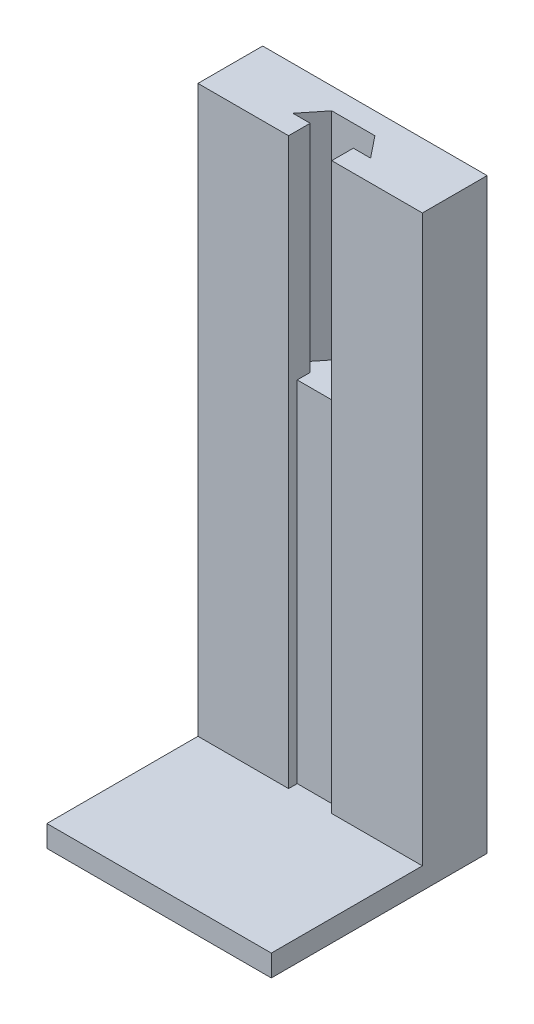
ISO-10303-21;
HEADER;
FILE_DESCRIPTION(('STEP AP214'),'2;1');
FILE_NAME('part.step','',(''),(''),'','','');
FILE_SCHEMA(('AUTOMOTIVE_DESIGN { 1 0 10303 214 1 1 1 1 }'));
ENDSEC;
DATA;
#1=APPLICATION_CONTEXT('core data for automotive mechanical design processes');
#2=APPLICATION_PROTOCOL_DEFINITION('international standard','automotive_design',2000,#1);
#3=PRODUCT_CONTEXT('',#1,'mechanical');
#4=PRODUCT('Part','Part','',(#3));
#5=PRODUCT_RELATED_PRODUCT_CATEGORY('part','',(#4));
#6=PRODUCT_DEFINITION_FORMATION('','',#4);
#7=PRODUCT_DEFINITION_CONTEXT('part definition',#1,'design');
#8=PRODUCT_DEFINITION('design','',#6,#7);
#9=PRODUCT_DEFINITION_SHAPE('','',#8);
#10=(LENGTH_UNIT() NAMED_UNIT(*) SI_UNIT(.MILLI.,.METRE.));
#11=(NAMED_UNIT(*) PLANE_ANGLE_UNIT() SI_UNIT($,.RADIAN.));
#12=(NAMED_UNIT(*) SI_UNIT($,.STERADIAN.) SOLID_ANGLE_UNIT());
#13=UNCERTAINTY_MEASURE_WITH_UNIT(LENGTH_MEASURE(1.E-05),#10,'distance_accuracy_value','');
#14=(GEOMETRIC_REPRESENTATION_CONTEXT(3) GLOBAL_UNCERTAINTY_ASSIGNED_CONTEXT((#13)) GLOBAL_UNIT_ASSIGNED_CONTEXT((#10,
#11,#12)) REPRESENTATION_CONTEXT('',''));
#15=CARTESIAN_POINT('',(0.,0.,0.));
#16=DIRECTION('',(0.,0.,1.));
#17=DIRECTION('',(1.,0.,0.));
#18=AXIS2_PLACEMENT_3D('',#15,#16,#17);
#19=CARTESIAN_POINT('',(-26.,136.,-10.));
#20=DIRECTION('',(0.,0.,-1.));
#21=DIRECTION('',(-1.,0.,0.));
#22=AXIS2_PLACEMENT_3D('',#19,#20,#21);
#23=PLANE('',#22);
#24=DIRECTION('',(1.,0.,0.));
#25=VECTOR('',#24,1.);
#26=CARTESIAN_POINT('',(-26.,5.,-10.));
#27=LINE('',#26,#25);
#28=CARTESIAN_POINT('',(-26.,5.,-10.));
#29=VERTEX_POINT('',#28);
#30=CARTESIAN_POINT('',(-5.,5.,-10.));
#31=VERTEX_POINT('',#30);
#32=EDGE_CURVE('E66',#29,#31,#27,.T.);
#33=ORIENTED_EDGE('',*,*,#32,.T.);
#34=DIRECTION('',(0.,1.,0.));
#35=VECTOR('',#34,1.);
#36=CARTESIAN_POINT('',(-5.,86.,-10.));
#37=LINE('',#36,#35);
#38=CARTESIAN_POINT('',(-5.,136.,-10.));
#39=VERTEX_POINT('',#38);
#40=EDGE_CURVE('E158',#31,#39,#37,.T.);
#41=ORIENTED_EDGE('',*,*,#40,.T.);
#42=DIRECTION('',(1.,0.,0.));
#43=VECTOR('',#42,1.);
#44=CARTESIAN_POINT('',(-26.,136.,-10.));
#45=LINE('',#44,#43);
#46=CARTESIAN_POINT('',(-26.,136.,-10.));
#47=VERTEX_POINT('',#46);
#48=EDGE_CURVE('E299',#47,#39,#45,.T.);
#49=ORIENTED_EDGE('',*,*,#48,.F.);
#50=DIRECTION('',(0.,-1.,0.));
#51=VECTOR('',#50,1.);
#52=CARTESIAN_POINT('',(-26.,136.,-10.));
#53=LINE('',#52,#51);
#54=EDGE_CURVE('E177',#47,#29,#53,.T.);
#55=ORIENTED_EDGE('',*,*,#54,.T.);
#56=EDGE_LOOP('',(#33,#41,#49,#55));
#57=FACE_BOUND('',#56,.T.);
#58=ADVANCED_FACE('F43',(#57),#23,.F.);
#59=CARTESIAN_POINT('',(0.,5.,0.));
#60=DIRECTION('',(0.,-1.,0.));
#61=DIRECTION('',(0.,0.,-1.));
#62=AXIS2_PLACEMENT_3D('',#59,#60,#61);
#63=PLANE('',#62);
#64=ORIENTED_EDGE('',*,*,#32,.F.);
#65=DIRECTION('',(0.,0.,1.));
#66=VECTOR('',#65,1.);
#67=CARTESIAN_POINT('',(-26.,5.,25.));
#68=LINE('',#67,#66);
#69=CARTESIAN_POINT('',(-26.,5.,25.));
#70=VERTEX_POINT('',#69);
#71=EDGE_CURVE('E197',#29,#70,#68,.T.);
#72=ORIENTED_EDGE('',*,*,#71,.T.);
#73=DIRECTION('',(1.,0.,0.));
#74=VECTOR('',#73,1.);
#75=CARTESIAN_POINT('',(-26.,5.,25.));
#76=LINE('',#75,#74);
#77=CARTESIAN_POINT('',(26.,5.,25.));
#78=VERTEX_POINT('',#77);
#79=EDGE_CURVE('E200',#70,#78,#76,.T.);
#80=ORIENTED_EDGE('',*,*,#79,.T.);
#81=DIRECTION('',(0.,0.,-1.));
#82=VECTOR('',#81,1.);
#83=CARTESIAN_POINT('',(26.,5.,25.));
#84=LINE('',#83,#82);
#85=CARTESIAN_POINT('',(26.,5.,-10.));
#86=VERTEX_POINT('',#85);
#87=EDGE_CURVE('E194',#78,#86,#84,.T.);
#88=ORIENTED_EDGE('',*,*,#87,.T.);
#89=CARTESIAN_POINT('',(5.,5.,-10.));
#90=VERTEX_POINT('',#89);
#91=EDGE_CURVE('E179',#90,#86,#27,.T.);
#92=ORIENTED_EDGE('',*,*,#91,.F.);
#93=DIRECTION('',(0.,0.,-1.));
#94=VECTOR('',#93,1.);
#95=CARTESIAN_POINT('',(5.,5.,-10.));
#96=LINE('',#95,#94);
#97=CARTESIAN_POINT('',(5.,5.,-12.));
#98=VERTEX_POINT('',#97);
#99=EDGE_CURVE('E172',#90,#98,#96,.T.);
#100=ORIENTED_EDGE('',*,*,#99,.T.);
#101=DIRECTION('',(-1.,0.,0.));
#102=VECTOR('',#101,1.);
#103=CARTESIAN_POINT('',(-5.,5.,-12.));
#104=LINE('',#103,#102);
#105=CARTESIAN_POINT('',(-5.,5.,-12.));
#106=VERTEX_POINT('',#105);
#107=EDGE_CURVE('E171',#98,#106,#104,.T.);
#108=ORIENTED_EDGE('',*,*,#107,.T.);
#109=DIRECTION('',(0.,0.,1.));
#110=VECTOR('',#109,1.);
#111=CARTESIAN_POINT('',(-5.,5.,-10.));
#112=LINE('',#111,#110);
#113=EDGE_CURVE('E160',#106,#31,#112,.T.);
#114=ORIENTED_EDGE('',*,*,#113,.T.);
#115=EDGE_LOOP('',(#64,#72,#80,#88,#92,#100,#108,#114));
#116=FACE_BOUND('',#115,.T.);
#117=ADVANCED_FACE('F168',(#116),#63,.F.);
#118=CARTESIAN_POINT('',(26.,5.,25.));
#119=DIRECTION('',(-1.,0.,0.));
#120=DIRECTION('',(0.,0.,1.));
#121=AXIS2_PLACEMENT_3D('',#118,#119,#120);
#122=PLANE('',#121);
#123=DIRECTION('',(0.,0.,-1.));
#124=VECTOR('',#123,1.);
#125=CARTESIAN_POINT('',(26.,0.,25.));
#126=LINE('',#125,#124);
#127=CARTESIAN_POINT('',(26.,0.,25.));
#128=VERTEX_POINT('',#127);
#129=CARTESIAN_POINT('',(26.,0.,-25.));
#130=VERTEX_POINT('',#129);
#131=EDGE_CURVE('E193',#128,#130,#126,.T.);
#132=ORIENTED_EDGE('',*,*,#131,.T.);
#133=DIRECTION('',(0.,-1.,0.));
#134=VECTOR('',#133,1.);
#135=CARTESIAN_POINT('',(26.,5.,-25.));
#136=LINE('',#135,#134);
#137=CARTESIAN_POINT('',(26.,136.,-25.));
#138=VERTEX_POINT('',#137);
#139=EDGE_CURVE('E12',#138,#130,#136,.T.);
#140=ORIENTED_EDGE('',*,*,#139,.F.);
#141=DIRECTION('',(0.,0.,-1.));
#142=VECTOR('',#141,1.);
#143=CARTESIAN_POINT('',(26.,136.,-25.));
#144=LINE('',#143,#142);
#145=CARTESIAN_POINT('',(26.,136.,-10.));
#146=VERTEX_POINT('',#145);
#147=EDGE_CURVE('E300',#146,#138,#144,.T.);
#148=ORIENTED_EDGE('',*,*,#147,.F.);
#149=DIRECTION('',(0.,-1.,0.));
#150=VECTOR('',#149,1.);
#151=CARTESIAN_POINT('',(26.,136.,-10.));
#152=LINE('',#151,#150);
#153=EDGE_CURVE('E189',#146,#86,#152,.T.);
#154=ORIENTED_EDGE('',*,*,#153,.T.);
#155=ORIENTED_EDGE('',*,*,#87,.F.);
#156=DIRECTION('',(0.,-1.,0.));
#157=VECTOR('',#156,1.);
#158=CARTESIAN_POINT('',(26.,5.,25.));
#159=LINE('',#158,#157);
#160=EDGE_CURVE('E202',#78,#128,#159,.T.);
#161=ORIENTED_EDGE('',*,*,#160,.T.);
#162=EDGE_LOOP('',(#132,#140,#148,#154,#155,#161));
#163=FACE_BOUND('',#162,.T.);
#164=ADVANCED_FACE('F45',(#163),#122,.F.);
#165=CARTESIAN_POINT('',(-26.,5.,-25.));
#166=DIRECTION('',(0.,0.,1.));
#167=DIRECTION('',(1.,0.,0.));
#168=AXIS2_PLACEMENT_3D('',#165,#166,#167);
#169=PLANE('',#168);
#170=DIRECTION('',(-1.,0.,0.));
#171=VECTOR('',#170,1.);
#172=CARTESIAN_POINT('',(-26.,0.,-25.));
#173=LINE('',#172,#171);
#174=CARTESIAN_POINT('',(-26.,0.,-25.));
#175=VERTEX_POINT('',#174);
#176=EDGE_CURVE('E205',#130,#175,#173,.T.);
#177=ORIENTED_EDGE('',*,*,#176,.T.);
#178=DIRECTION('',(0.,-1.,0.));
#179=VECTOR('',#178,1.);
#180=CARTESIAN_POINT('',(-26.,5.,-25.));
#181=LINE('',#180,#179);
#182=CARTESIAN_POINT('',(-26.,136.,-25.));
#183=VERTEX_POINT('',#182);
#184=EDGE_CURVE('E51',#183,#175,#181,.T.);
#185=ORIENTED_EDGE('',*,*,#184,.F.);
#186=DIRECTION('',(-1.,0.,0.));
#187=VECTOR('',#186,1.);
#188=CARTESIAN_POINT('',(-26.,136.,-25.));
#189=LINE('',#188,#187);
#190=EDGE_CURVE('E187',#138,#183,#189,.T.);
#191=ORIENTED_EDGE('',*,*,#190,.F.);
#192=ORIENTED_EDGE('',*,*,#139,.T.);
#193=EDGE_LOOP('',(#177,#185,#191,#192));
#194=FACE_BOUND('',#193,.T.);
#195=ADVANCED_FACE('F304',(#194),#169,.F.);
#196=CARTESIAN_POINT('',(-26.,5.,25.));
#197=DIRECTION('',(1.,0.,0.));
#198=DIRECTION('',(0.,0.,-1.));
#199=AXIS2_PLACEMENT_3D('',#196,#197,#198);
#200=PLANE('',#199);
#201=DIRECTION('',(0.,0.,1.));
#202=VECTOR('',#201,1.);
#203=CARTESIAN_POINT('',(-26.,0.,25.));
#204=LINE('',#203,#202);
#205=CARTESIAN_POINT('',(-26.,0.,25.));
#206=VERTEX_POINT('',#205);
#207=EDGE_CURVE('E207',#175,#206,#204,.T.);
#208=ORIENTED_EDGE('',*,*,#207,.T.);
#209=DIRECTION('',(0.,-1.,0.));
#210=VECTOR('',#209,1.);
#211=CARTESIAN_POINT('',(-26.,5.,25.));
#212=LINE('',#211,#210);
#213=EDGE_CURVE('E212',#70,#206,#212,.T.);
#214=ORIENTED_EDGE('',*,*,#213,.F.);
#215=ORIENTED_EDGE('',*,*,#71,.F.);
#216=ORIENTED_EDGE('',*,*,#54,.F.);
#217=DIRECTION('',(0.,0.,1.));
#218=VECTOR('',#217,1.);
#219=CARTESIAN_POINT('',(-26.,136.,-25.));
#220=LINE('',#219,#218);
#221=EDGE_CURVE('E178',#183,#47,#220,.T.);
#222=ORIENTED_EDGE('',*,*,#221,.F.);
#223=ORIENTED_EDGE('',*,*,#184,.T.);
#224=EDGE_LOOP('',(#208,#214,#215,#216,#222,#223));
#225=FACE_BOUND('',#224,.T.);
#226=ADVANCED_FACE('F218',(#225),#200,.F.);
#227=CARTESIAN_POINT('',(-26.,5.,25.));
#228=DIRECTION('',(0.,0.,-1.));
#229=DIRECTION('',(-1.,0.,0.));
#230=AXIS2_PLACEMENT_3D('',#227,#228,#229);
#231=PLANE('',#230);
#232=DIRECTION('',(1.,0.,0.));
#233=VECTOR('',#232,1.);
#234=CARTESIAN_POINT('',(-26.,0.,25.));
#235=LINE('',#234,#233);
#236=EDGE_CURVE('E198',#206,#128,#235,.T.);
#237=ORIENTED_EDGE('',*,*,#236,.T.);
#238=ORIENTED_EDGE('',*,*,#160,.F.);
#239=ORIENTED_EDGE('',*,*,#79,.F.);
#240=ORIENTED_EDGE('',*,*,#213,.T.);
#241=EDGE_LOOP('',(#237,#238,#239,#240));
#242=FACE_BOUND('',#241,.T.);
#243=ADVANCED_FACE('F229',(#242),#231,.F.);
#244=CARTESIAN_POINT('',(0.,0.,0.));
#245=DIRECTION('',(0.,-1.,0.));
#246=DIRECTION('',(0.,0.,-1.));
#247=AXIS2_PLACEMENT_3D('',#244,#245,#246);
#248=PLANE('',#247);
#249=ORIENTED_EDGE('',*,*,#131,.F.);
#250=ORIENTED_EDGE('',*,*,#236,.F.);
#251=ORIENTED_EDGE('',*,*,#207,.F.);
#252=ORIENTED_EDGE('',*,*,#176,.F.);
#253=EDGE_LOOP('',(#249,#250,#251,#252));
#254=FACE_BOUND('',#253,.T.);
#255=ADVANCED_FACE('F226',(#254),#248,.T.);
#256=DIRECTION('',(0.,1.,0.));
#257=VECTOR('',#256,1.);
#258=CARTESIAN_POINT('',(5.,86.,-10.));
#259=LINE('',#258,#257);
#260=CARTESIAN_POINT('',(4.99999999999999,136.,-10.));
#261=VERTEX_POINT('',#260);
#262=EDGE_CURVE('E58',#90,#261,#259,.T.);
#263=ORIENTED_EDGE('',*,*,#262,.F.);
#264=ORIENTED_EDGE('',*,*,#91,.T.);
#265=ORIENTED_EDGE('',*,*,#153,.F.);
#266=EDGE_CURVE('E182',#261,#146,#45,.T.);
#267=ORIENTED_EDGE('',*,*,#266,.F.);
#268=EDGE_LOOP('',(#263,#264,#265,#267));
#269=FACE_BOUND('',#268,.T.);
#270=ADVANCED_FACE('F237',(#269),#23,.F.);
#271=CARTESIAN_POINT('',(0.,136.,0.));
#272=DIRECTION('',(0.,1.,0.));
#273=DIRECTION('',(0.,0.,1.));
#274=AXIS2_PLACEMENT_3D('',#271,#272,#273);
#275=PLANE('',#274);
#276=DIRECTION('',(0.,0.,1.));
#277=VECTOR('',#276,1.);
#278=CARTESIAN_POINT('',(-5.,136.,-15.));
#279=LINE('',#278,#277);
#280=CARTESIAN_POINT('',(-5.,136.,-15.));
#281=VERTEX_POINT('',#280);
#282=EDGE_CURVE('E163',#281,#39,#279,.T.);
#283=ORIENTED_EDGE('',*,*,#282,.F.);
#284=DIRECTION('',(1.,0.,0.));
#285=VECTOR('',#284,1.);
#286=CARTESIAN_POINT('',(-9.,136.,-15.));
#287=LINE('',#286,#285);
#288=CARTESIAN_POINT('',(-9.,136.,-15.));
#289=VERTEX_POINT('',#288);
#290=EDGE_CURVE('E256',#289,#281,#287,.T.);
#291=ORIENTED_EDGE('',*,*,#290,.F.);
#292=DIRECTION('',(-0.624695047554424,0.,0.78086880944303));
#293=VECTOR('',#292,1.);
#294=CARTESIAN_POINT('',(-5.,136.,-20.));
#295=LINE('',#294,#293);
#296=CARTESIAN_POINT('',(-5.,136.,-20.));
#297=VERTEX_POINT('',#296);
#298=EDGE_CURVE('E284',#297,#289,#295,.T.);
#299=ORIENTED_EDGE('',*,*,#298,.F.);
#300=DIRECTION('',(-1.,0.,0.));
#301=VECTOR('',#300,1.);
#302=CARTESIAN_POINT('',(5.,136.,-20.));
#303=LINE('',#302,#301);
#304=CARTESIAN_POINT('',(5.,136.,-20.));
#305=VERTEX_POINT('',#304);
#306=EDGE_CURVE('E281',#305,#297,#303,.T.);
#307=ORIENTED_EDGE('',*,*,#306,.F.);
#308=DIRECTION('',(-0.624695047554425,0.,-0.78086880944303));
#309=VECTOR('',#308,1.);
#310=CARTESIAN_POINT('',(9.,136.,-15.));
#311=LINE('',#310,#309);
#312=CARTESIAN_POINT('',(9.,136.,-15.));
#313=VERTEX_POINT('',#312);
#314=EDGE_CURVE('E278',#313,#305,#311,.T.);
#315=ORIENTED_EDGE('',*,*,#314,.F.);
#316=DIRECTION('',(1.,0.,0.));
#317=VECTOR('',#316,1.);
#318=CARTESIAN_POINT('',(5.,136.,-15.));
#319=LINE('',#318,#317);
#320=CARTESIAN_POINT('',(5.,136.,-15.));
#321=VERTEX_POINT('',#320);
#322=EDGE_CURVE('E275',#321,#313,#319,.T.);
#323=ORIENTED_EDGE('',*,*,#322,.F.);
#324=DIRECTION('',(0.,0.,-1.));
#325=VECTOR('',#324,1.);
#326=CARTESIAN_POINT('',(5.,136.,-10.));
#327=LINE('',#326,#325);
#328=EDGE_CURVE('E273',#261,#321,#327,.T.);
#329=ORIENTED_EDGE('',*,*,#328,.F.);
#330=ORIENTED_EDGE('',*,*,#266,.T.);
#331=ORIENTED_EDGE('',*,*,#147,.T.);
#332=ORIENTED_EDGE('',*,*,#190,.T.);
#333=ORIENTED_EDGE('',*,*,#221,.T.);
#334=ORIENTED_EDGE('',*,*,#48,.T.);
#335=EDGE_LOOP('',(#283,#291,#299,#307,#315,#323,#329,#330,#331,#332,#333,#334));
#336=FACE_BOUND('',#335,.T.);
#337=ADVANCED_FACE('F303',(#336),#275,.T.);
#338=CARTESIAN_POINT('',(-5.,86.,-15.));
#339=DIRECTION('',(-1.,0.,0.));
#340=DIRECTION('',(0.,0.,1.));
#341=AXIS2_PLACEMENT_3D('',#338,#339,#340);
#342=PLANE('',#341);
#343=ORIENTED_EDGE('',*,*,#282,.T.);
#344=ORIENTED_EDGE('',*,*,#40,.F.);
#345=ORIENTED_EDGE('',*,*,#113,.F.);
#346=DIRECTION('',(0.,1.,0.));
#347=VECTOR('',#346,1.);
#348=CARTESIAN_POINT('',(-5.,5.,-12.));
#349=LINE('',#348,#347);
#350=CARTESIAN_POINT('',(-5.,86.,-12.));
#351=VERTEX_POINT('',#350);
#352=EDGE_CURVE('E249',#106,#351,#349,.T.);
#353=ORIENTED_EDGE('',*,*,#352,.T.);
#354=DIRECTION('',(0.,0.,1.));
#355=VECTOR('',#354,1.);
#356=CARTESIAN_POINT('',(-5.,86.,-15.));
#357=LINE('',#356,#355);
#358=CARTESIAN_POINT('',(-5.,86.,-15.));
#359=VERTEX_POINT('',#358);
#360=EDGE_CURVE('E252',#359,#351,#357,.T.);
#361=ORIENTED_EDGE('',*,*,#360,.F.);
#362=DIRECTION('',(0.,1.,0.));
#363=VECTOR('',#362,1.);
#364=CARTESIAN_POINT('',(-5.,86.,-15.));
#365=LINE('',#364,#363);
#366=EDGE_CURVE('E184',#359,#281,#365,.T.);
#367=ORIENTED_EDGE('',*,*,#366,.T.);
#368=EDGE_LOOP('',(#343,#344,#345,#353,#361,#367));
#369=FACE_BOUND('',#368,.T.);
#370=ADVANCED_FACE('F159',(#369),#342,.F.);
#371=CARTESIAN_POINT('',(-9.,86.,-15.));
#372=DIRECTION('',(0.,0.,1.));
#373=DIRECTION('',(1.,0.,0.));
#374=AXIS2_PLACEMENT_3D('',#371,#372,#373);
#375=PLANE('',#374);
#376=ORIENTED_EDGE('',*,*,#290,.T.);
#377=ORIENTED_EDGE('',*,*,#366,.F.);
#378=DIRECTION('',(1.,0.,0.));
#379=VECTOR('',#378,1.);
#380=CARTESIAN_POINT('',(-9.,86.,-15.));
#381=LINE('',#380,#379);
#382=CARTESIAN_POINT('',(-9.,86.,-15.));
#383=VERTEX_POINT('',#382);
#384=EDGE_CURVE('E166',#383,#359,#381,.T.);
#385=ORIENTED_EDGE('',*,*,#384,.F.);
#386=DIRECTION('',(0.,1.,0.));
#387=VECTOR('',#386,1.);
#388=CARTESIAN_POINT('',(-9.,86.,-15.));
#389=LINE('',#388,#387);
#390=EDGE_CURVE('E290',#383,#289,#389,.T.);
#391=ORIENTED_EDGE('',*,*,#390,.T.);
#392=EDGE_LOOP('',(#376,#377,#385,#391));
#393=FACE_BOUND('',#392,.T.);
#394=ADVANCED_FACE('F356',(#393),#375,.F.);
#395=CARTESIAN_POINT('',(-5.,86.,-20.));
#396=DIRECTION('',(-0.78086880944303,0.,-0.624695047554424));
#397=DIRECTION('',(-0.624695047554424,0.,0.78086880944303));
#398=AXIS2_PLACEMENT_3D('',#395,#396,#397);
#399=PLANE('',#398);
#400=ORIENTED_EDGE('',*,*,#298,.T.);
#401=ORIENTED_EDGE('',*,*,#390,.F.);
#402=DIRECTION('',(-0.624695047554424,0.,0.78086880944303));
#403=VECTOR('',#402,1.);
#404=CARTESIAN_POINT('',(-5.,86.,-20.));
#405=LINE('',#404,#403);
#406=CARTESIAN_POINT('',(-5.,86.,-20.));
#407=VERTEX_POINT('',#406);
#408=EDGE_CURVE('E267',#407,#383,#405,.T.);
#409=ORIENTED_EDGE('',*,*,#408,.F.);
#410=DIRECTION('',(0.,1.,0.));
#411=VECTOR('',#410,1.);
#412=CARTESIAN_POINT('',(-5.,86.,-20.));
#413=LINE('',#412,#411);
#414=EDGE_CURVE('E292',#407,#297,#413,.T.);
#415=ORIENTED_EDGE('',*,*,#414,.T.);
#416=EDGE_LOOP('',(#400,#401,#409,#415));
#417=FACE_BOUND('',#416,.T.);
#418=ADVANCED_FACE('F360',(#417),#399,.F.);
#419=CARTESIAN_POINT('',(5.,86.,-20.));
#420=DIRECTION('',(0.,0.,-1.));
#421=DIRECTION('',(-1.,0.,0.));
#422=AXIS2_PLACEMENT_3D('',#419,#420,#421);
#423=PLANE('',#422);
#424=ORIENTED_EDGE('',*,*,#306,.T.);
#425=ORIENTED_EDGE('',*,*,#414,.F.);
#426=DIRECTION('',(-1.,0.,0.));
#427=VECTOR('',#426,1.);
#428=CARTESIAN_POINT('',(5.,86.,-20.));
#429=LINE('',#428,#427);
#430=CARTESIAN_POINT('',(5.,86.,-20.));
#431=VERTEX_POINT('',#430);
#432=EDGE_CURVE('E264',#431,#407,#429,.T.);
#433=ORIENTED_EDGE('',*,*,#432,.F.);
#434=DIRECTION('',(0.,1.,0.));
#435=VECTOR('',#434,1.);
#436=CARTESIAN_POINT('',(5.,86.,-20.));
#437=LINE('',#436,#435);
#438=EDGE_CURVE('E294',#431,#305,#437,.T.);
#439=ORIENTED_EDGE('',*,*,#438,.T.);
#440=EDGE_LOOP('',(#424,#425,#433,#439));
#441=FACE_BOUND('',#440,.T.);
#442=ADVANCED_FACE('F371',(#441),#423,.F.);
#443=CARTESIAN_POINT('',(9.,86.,-15.));
#444=DIRECTION('',(0.78086880944303,0.,-0.624695047554425));
#445=DIRECTION('',(-0.624695047554425,0.,-0.78086880944303));
#446=AXIS2_PLACEMENT_3D('',#443,#444,#445);
#447=PLANE('',#446);
#448=ORIENTED_EDGE('',*,*,#314,.T.);
#449=ORIENTED_EDGE('',*,*,#438,.F.);
#450=DIRECTION('',(-0.624695047554425,0.,-0.78086880944303));
#451=VECTOR('',#450,1.);
#452=CARTESIAN_POINT('',(9.,86.,-15.));
#453=LINE('',#452,#451);
#454=CARTESIAN_POINT('',(9.,86.,-15.));
#455=VERTEX_POINT('',#454);
#456=EDGE_CURVE('E261',#455,#431,#453,.T.);
#457=ORIENTED_EDGE('',*,*,#456,.F.);
#458=DIRECTION('',(0.,1.,0.));
#459=VECTOR('',#458,1.);
#460=CARTESIAN_POINT('',(9.,86.,-15.));
#461=LINE('',#460,#459);
#462=EDGE_CURVE('E296',#455,#313,#461,.T.);
#463=ORIENTED_EDGE('',*,*,#462,.T.);
#464=EDGE_LOOP('',(#448,#449,#457,#463));
#465=FACE_BOUND('',#464,.T.);
#466=ADVANCED_FACE('F382',(#465),#447,.F.);
#467=CARTESIAN_POINT('',(5.,86.,-15.));
#468=DIRECTION('',(0.,0.,1.));
#469=DIRECTION('',(1.,0.,0.));
#470=AXIS2_PLACEMENT_3D('',#467,#468,#469);
#471=PLANE('',#470);
#472=ORIENTED_EDGE('',*,*,#322,.T.);
#473=ORIENTED_EDGE('',*,*,#462,.F.);
#474=DIRECTION('',(1.,0.,0.));
#475=VECTOR('',#474,1.);
#476=CARTESIAN_POINT('',(5.,86.,-15.));
#477=LINE('',#476,#475);
#478=CARTESIAN_POINT('',(5.,86.,-15.));
#479=VERTEX_POINT('',#478);
#480=EDGE_CURVE('E258',#479,#455,#477,.T.);
#481=ORIENTED_EDGE('',*,*,#480,.F.);
#482=DIRECTION('',(0.,1.,0.));
#483=VECTOR('',#482,1.);
#484=CARTESIAN_POINT('',(5.,86.,-15.));
#485=LINE('',#484,#483);
#486=EDGE_CURVE('E239',#479,#321,#485,.T.);
#487=ORIENTED_EDGE('',*,*,#486,.T.);
#488=EDGE_LOOP('',(#472,#473,#481,#487));
#489=FACE_BOUND('',#488,.T.);
#490=ADVANCED_FACE('F392',(#489),#471,.F.);
#491=CARTESIAN_POINT('',(5.,86.,-10.));
#492=DIRECTION('',(1.,0.,0.));
#493=DIRECTION('',(0.,0.,-1.));
#494=AXIS2_PLACEMENT_3D('',#491,#492,#493);
#495=PLANE('',#494);
#496=ORIENTED_EDGE('',*,*,#328,.T.);
#497=ORIENTED_EDGE('',*,*,#486,.F.);
#498=DIRECTION('',(0.,0.,-1.));
#499=VECTOR('',#498,1.);
#500=CARTESIAN_POINT('',(5.,86.,-10.));
#501=LINE('',#500,#499);
#502=CARTESIAN_POINT('',(5.,86.,-12.));
#503=VERTEX_POINT('',#502);
#504=EDGE_CURVE('E255',#503,#479,#501,.T.);
#505=ORIENTED_EDGE('',*,*,#504,.F.);
#506=DIRECTION('',(0.,1.,0.));
#507=VECTOR('',#506,1.);
#508=CARTESIAN_POINT('',(5.,5.,-12.));
#509=LINE('',#508,#507);
#510=EDGE_CURVE('E243',#98,#503,#509,.T.);
#511=ORIENTED_EDGE('',*,*,#510,.F.);
#512=ORIENTED_EDGE('',*,*,#99,.F.);
#513=ORIENTED_EDGE('',*,*,#262,.T.);
#514=EDGE_LOOP('',(#496,#497,#505,#511,#512,#513));
#515=FACE_BOUND('',#514,.T.);
#516=ADVANCED_FACE('F241',(#515),#495,.F.);
#517=CARTESIAN_POINT('',(0.,86.,0.));
#518=DIRECTION('',(0.,1.,0.));
#519=DIRECTION('',(0.,0.,1.));
#520=AXIS2_PLACEMENT_3D('',#517,#518,#519);
#521=PLANE('',#520);
#522=DIRECTION('',(-1.,0.,0.));
#523=VECTOR('',#522,1.);
#524=CARTESIAN_POINT('',(-5.,86.,-12.));
#525=LINE('',#524,#523);
#526=EDGE_CURVE('E173',#503,#351,#525,.T.);
#527=ORIENTED_EDGE('',*,*,#526,.F.);
#528=ORIENTED_EDGE('',*,*,#504,.T.);
#529=ORIENTED_EDGE('',*,*,#480,.T.);
#530=ORIENTED_EDGE('',*,*,#456,.T.);
#531=ORIENTED_EDGE('',*,*,#432,.T.);
#532=ORIENTED_EDGE('',*,*,#408,.T.);
#533=ORIENTED_EDGE('',*,*,#384,.T.);
#534=ORIENTED_EDGE('',*,*,#360,.T.);
#535=EDGE_LOOP('',(#527,#528,#529,#530,#531,#532,#533,#534));
#536=FACE_BOUND('',#535,.T.);
#537=ADVANCED_FACE('F410',(#536),#521,.T.);
#538=CARTESIAN_POINT('',(-5.,5.,-12.));
#539=DIRECTION('',(0.,0.,-1.));
#540=DIRECTION('',(-1.,0.,0.));
#541=AXIS2_PLACEMENT_3D('',#538,#539,#540);
#542=PLANE('',#541);
#543=ORIENTED_EDGE('',*,*,#526,.T.);
#544=ORIENTED_EDGE('',*,*,#352,.F.);
#545=ORIENTED_EDGE('',*,*,#107,.F.);
#546=ORIENTED_EDGE('',*,*,#510,.T.);
#547=EDGE_LOOP('',(#543,#544,#545,#546));
#548=FACE_BOUND('',#547,.T.);
#549=ADVANCED_FACE('F415',(#548),#542,.F.);
#550=CLOSED_SHELL('',(#58,#117,#164,#195,#226,#243,#255,#270,#337,#370,#394,#418,#442,#466,#490,
#516,#537,#549));
#551=MANIFOLD_SOLID_BREP('B2',#550);
#552=ADVANCED_BREP_SHAPE_REPRESENTATION('',(#18,#551),#14);
#553=SHAPE_DEFINITION_REPRESENTATION(#9,#552);
ENDSEC;
END-ISO-10303-21;
